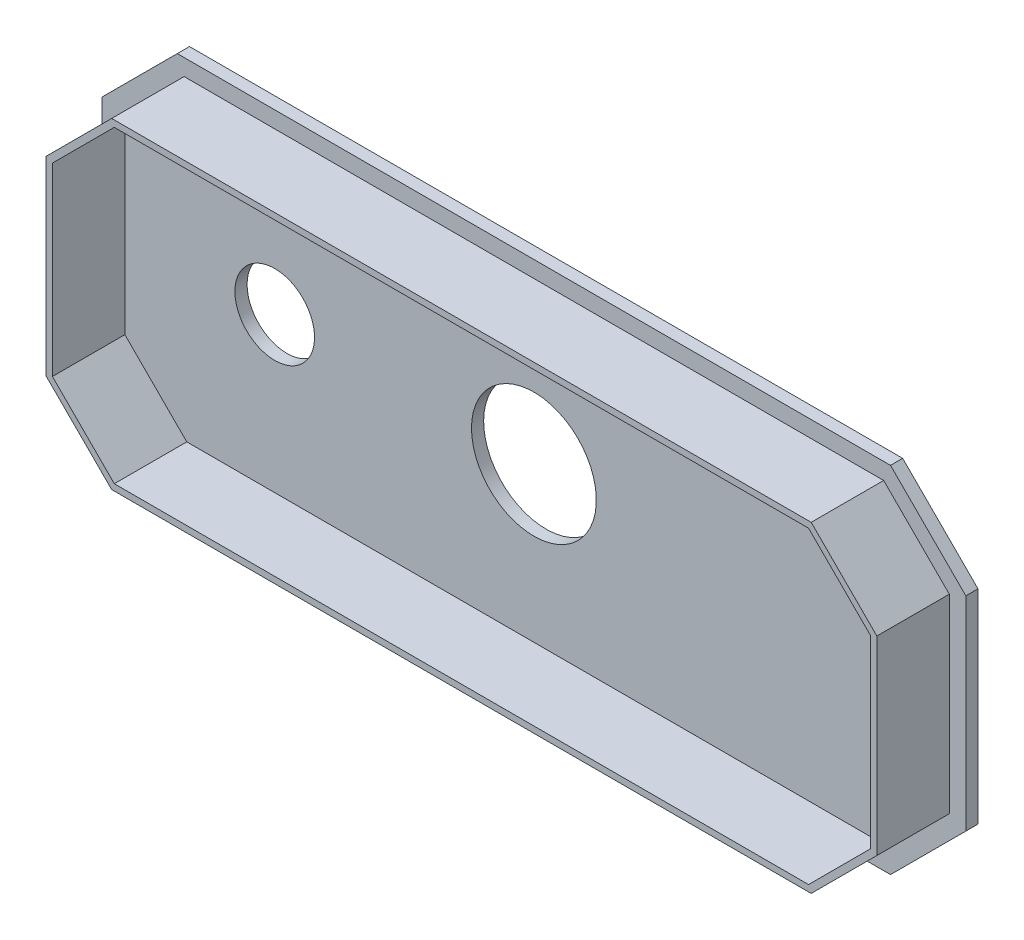
ISO-10303-21;
HEADER;
FILE_DESCRIPTION(('STEP AP214'),'2;1');
FILE_NAME('part.step','',(''),(''),'','','');
FILE_SCHEMA(('AUTOMOTIVE_DESIGN { 1 0 10303 214 1 1 1 1 }'));
ENDSEC;
DATA;
#1=APPLICATION_CONTEXT('core data for automotive mechanical design processes');
#2=APPLICATION_PROTOCOL_DEFINITION('international standard','automotive_design',2000,#1);
#3=PRODUCT_CONTEXT('',#1,'mechanical');
#4=PRODUCT('Part','Part','',(#3));
#5=PRODUCT_RELATED_PRODUCT_CATEGORY('part','',(#4));
#6=PRODUCT_DEFINITION_FORMATION('','',#4);
#7=PRODUCT_DEFINITION_CONTEXT('part definition',#1,'design');
#8=PRODUCT_DEFINITION('design','',#6,#7);
#9=PRODUCT_DEFINITION_SHAPE('','',#8);
#10=(LENGTH_UNIT() NAMED_UNIT(*) SI_UNIT(.MILLI.,.METRE.));
#11=(NAMED_UNIT(*) PLANE_ANGLE_UNIT() SI_UNIT($,.RADIAN.));
#12=(NAMED_UNIT(*) SI_UNIT($,.STERADIAN.) SOLID_ANGLE_UNIT());
#13=UNCERTAINTY_MEASURE_WITH_UNIT(LENGTH_MEASURE(1.E-05),#10,'distance_accuracy_value','');
#14=(GEOMETRIC_REPRESENTATION_CONTEXT(3) GLOBAL_UNCERTAINTY_ASSIGNED_CONTEXT((#13)) GLOBAL_UNIT_ASSIGNED_CONTEXT((#10,
#11,#12)) REPRESENTATION_CONTEXT('',''));
#15=CARTESIAN_POINT('',(0.,0.,0.));
#16=DIRECTION('',(0.,0.,1.));
#17=DIRECTION('',(1.,0.,0.));
#18=AXIS2_PLACEMENT_3D('',#15,#16,#17);
#19=CARTESIAN_POINT('',(0.,0.,0.8));
#20=DIRECTION('',(0.,0.,-1.));
#21=DIRECTION('',(-1.,0.,0.));
#22=AXIS2_PLACEMENT_3D('',#19,#20,#21);
#23=PLANE('',#22);
#24=DIRECTION('',(0.,1.,0.));
#25=VECTOR('',#24,1.);
#26=CARTESIAN_POINT('',(28.3845,-11.6459,0.8));
#27=LINE('',#26,#25);
#28=CARTESIAN_POINT('',(28.3845,-6.69615253169414,0.8));
#29=VERTEX_POINT('',#28);
#30=CARTESIAN_POINT('',(28.3845,6.6961525316942,0.8));
#31=VERTEX_POINT('',#30);
#32=EDGE_CURVE('E374',#29,#31,#27,.T.);
#33=ORIENTED_EDGE('',*,*,#32,.T.);
#34=DIRECTION('',(0.707106781186551,-0.707106781186544,0.));
#35=VECTOR('',#34,1.);
#36=CARTESIAN_POINT('',(23.4347525316941,11.6459,0.8));
#37=LINE('',#36,#35);
#38=CARTESIAN_POINT('',(23.4347525316941,11.6459,0.8));
#39=VERTEX_POINT('',#38);
#40=EDGE_CURVE('E331',#39,#31,#37,.T.);
#41=ORIENTED_EDGE('',*,*,#40,.F.);
#42=DIRECTION('',(-1.,0.,0.));
#43=VECTOR('',#42,1.);
#44=CARTESIAN_POINT('',(-28.3845,11.6459,0.8));
#45=LINE('',#44,#43);
#46=CARTESIAN_POINT('',(-23.4347525316941,11.6459,0.8));
#47=VERTEX_POINT('',#46);
#48=EDGE_CURVE('E377',#39,#47,#45,.T.);
#49=ORIENTED_EDGE('',*,*,#48,.T.);
#50=DIRECTION('',(0.707106781186551,0.707106781186544,0.));
#51=VECTOR('',#50,1.);
#52=CARTESIAN_POINT('',(-28.3845,6.6961525316942,0.8));
#53=LINE('',#52,#51);
#54=CARTESIAN_POINT('',(-28.3845,6.6961525316942,0.8));
#55=VERTEX_POINT('',#54);
#56=EDGE_CURVE('E350',#55,#47,#53,.T.);
#57=ORIENTED_EDGE('',*,*,#56,.F.);
#58=DIRECTION('',(0.,-1.,0.));
#59=VECTOR('',#58,1.);
#60=CARTESIAN_POINT('',(-28.3845,-11.6459,0.8));
#61=LINE('',#60,#59);
#62=CARTESIAN_POINT('',(-28.3845,-6.69615253169414,0.8));
#63=VERTEX_POINT('',#62);
#64=EDGE_CURVE('E46',#55,#63,#61,.T.);
#65=ORIENTED_EDGE('',*,*,#64,.T.);
#66=DIRECTION('',(-0.707106781186544,0.707106781186551,0.));
#67=VECTOR('',#66,1.);
#68=CARTESIAN_POINT('',(-28.3845,-6.69615253169414,0.8));
#69=LINE('',#68,#67);
#70=CARTESIAN_POINT('',(-23.4347525316942,-11.6459,0.8));
#71=VERTEX_POINT('',#70);
#72=EDGE_CURVE('E361',#71,#63,#69,.T.);
#73=ORIENTED_EDGE('',*,*,#72,.F.);
#74=DIRECTION('',(1.,0.,0.));
#75=VECTOR('',#74,1.);
#76=CARTESIAN_POINT('',(-28.3845,-11.6459,0.8));
#77=LINE('',#76,#75);
#78=CARTESIAN_POINT('',(23.4347525316942,-11.6459,0.8));
#79=VERTEX_POINT('',#78);
#80=EDGE_CURVE('E11',#71,#79,#77,.T.);
#81=ORIENTED_EDGE('',*,*,#80,.T.);
#82=DIRECTION('',(-0.707106781186544,-0.707106781186551,0.));
#83=VECTOR('',#82,1.);
#84=CARTESIAN_POINT('',(23.4347525316942,-11.6459,0.8));
#85=LINE('',#84,#83);
#86=EDGE_CURVE('E340',#29,#79,#85,.T.);
#87=ORIENTED_EDGE('',*,*,#86,.F.);
#88=EDGE_LOOP('',(#33,#41,#49,#57,#65,#73,#81,#87));
#89=FACE_BOUND('',#88,.T.);
#90=DIRECTION('',(-0.707106781186552,0.707106781186544,0.));
#91=VECTOR('',#90,1.);
#92=CARTESIAN_POINT('',(27.299700114,6.24681370645221,0.8));
#93=LINE('',#92,#91);
#94=CARTESIAN_POINT('',(27.299700114,6.24681370645221,0.8));
#95=VERTEX_POINT('',#94);
#96=CARTESIAN_POINT('',(22.9854137064521,10.561100114,0.8));
#97=VERTEX_POINT('',#96);
#98=EDGE_CURVE('E217',#95,#97,#93,.T.);
#99=ORIENTED_EDGE('',*,*,#98,.F.);
#100=DIRECTION('',(0.,1.,0.));
#101=VECTOR('',#100,1.);
#102=CARTESIAN_POINT('',(27.299700114,-6.24681370645216,0.8));
#103=LINE('',#102,#101);
#104=CARTESIAN_POINT('',(27.299700114,-6.24681370645216,0.8));
#105=VERTEX_POINT('',#104);
#106=EDGE_CURVE('E276',#105,#95,#103,.T.);
#107=ORIENTED_EDGE('',*,*,#106,.F.);
#108=DIRECTION('',(0.707106781186543,0.707106781186552,0.));
#109=VECTOR('',#108,1.);
#110=CARTESIAN_POINT('',(22.9854137064522,-10.561100114,0.8));
#111=LINE('',#110,#109);
#112=CARTESIAN_POINT('',(22.9854137064522,-10.561100114,0.8));
#113=VERTEX_POINT('',#112);
#114=EDGE_CURVE('E304',#113,#105,#111,.T.);
#115=ORIENTED_EDGE('',*,*,#114,.F.);
#116=DIRECTION('',(1.,0.,0.));
#117=VECTOR('',#116,1.);
#118=CARTESIAN_POINT('',(-22.9854137064522,-10.561100114,0.8));
#119=LINE('',#118,#117);
#120=CARTESIAN_POINT('',(-22.9854137064522,-10.561100114,0.8));
#121=VERTEX_POINT('',#120);
#122=EDGE_CURVE('E301',#121,#113,#119,.T.);
#123=ORIENTED_EDGE('',*,*,#122,.F.);
#124=DIRECTION('',(0.707106781186544,-0.707106781186551,0.));
#125=VECTOR('',#124,1.);
#126=CARTESIAN_POINT('',(-27.299700114,-6.24681370645216,0.8));
#127=LINE('',#126,#125);
#128=CARTESIAN_POINT('',(-27.299700114,-6.24681370645216,0.8));
#129=VERTEX_POINT('',#128);
#130=EDGE_CURVE('E298',#129,#121,#127,.T.);
#131=ORIENTED_EDGE('',*,*,#130,.F.);
#132=DIRECTION('',(0.,-1.,0.));
#133=VECTOR('',#132,1.);
#134=CARTESIAN_POINT('',(-27.299700114,6.24681370645221,0.8));
#135=LINE('',#134,#133);
#136=CARTESIAN_POINT('',(-27.299700114,6.24681370645221,0.8));
#137=VERTEX_POINT('',#136);
#138=EDGE_CURVE('E295',#137,#129,#135,.T.);
#139=ORIENTED_EDGE('',*,*,#138,.F.);
#140=DIRECTION('',(-0.707106781186551,-0.707106781186544,0.));
#141=VECTOR('',#140,1.);
#142=CARTESIAN_POINT('',(-22.9854137064522,10.561100114,0.8));
#143=LINE('',#142,#141);
#144=CARTESIAN_POINT('',(-22.9854137064522,10.561100114,0.8));
#145=VERTEX_POINT('',#144);
#146=EDGE_CURVE('E59',#145,#137,#143,.T.);
#147=ORIENTED_EDGE('',*,*,#146,.F.);
#148=DIRECTION('',(-1.,0.,0.));
#149=VECTOR('',#148,1.);
#150=CARTESIAN_POINT('',(22.9854137064521,10.561100114,0.8));
#151=LINE('',#150,#149);
#152=EDGE_CURVE('E54',#97,#145,#151,.T.);
#153=ORIENTED_EDGE('',*,*,#152,.F.);
#154=EDGE_LOOP('',(#99,#107,#115,#123,#131,#139,#147,#153));
#155=FACE_BOUND('',#154,.T.);
#156=ADVANCED_FACE('F37',(#89,#155),#23,.F.);
#157=CARTESIAN_POINT('',(28.3845,-11.6459,0.8));
#158=DIRECTION('',(-1.,0.,0.));
#159=DIRECTION('',(0.,0.,1.));
#160=AXIS2_PLACEMENT_3D('',#157,#158,#159);
#161=PLANE('',#160);
#162=DIRECTION('',(0.,1.,0.));
#163=VECTOR('',#162,1.);
#164=CARTESIAN_POINT('',(28.3845,-11.6459,0.));
#165=LINE('',#164,#163);
#166=CARTESIAN_POINT('',(28.3845,-6.69615253169414,0.));
#167=VERTEX_POINT('',#166);
#168=CARTESIAN_POINT('',(28.3845,6.69615253169419,0.));
#169=VERTEX_POINT('',#168);
#170=EDGE_CURVE('E372',#167,#169,#165,.T.);
#171=ORIENTED_EDGE('',*,*,#170,.T.);
#172=DIRECTION('',(0.,0.,1.));
#173=VECTOR('',#172,1.);
#174=CARTESIAN_POINT('',(28.3845,6.6961525316942,0.));
#175=LINE('',#174,#173);
#176=EDGE_CURVE('E337',#169,#31,#175,.T.);
#177=ORIENTED_EDGE('',*,*,#176,.T.);
#178=ORIENTED_EDGE('',*,*,#32,.F.);
#179=DIRECTION('',(0.,0.,1.));
#180=VECTOR('',#179,1.);
#181=CARTESIAN_POINT('',(28.3845,-6.69615253169414,0.));
#182=LINE('',#181,#180);
#183=EDGE_CURVE('E345',#167,#29,#182,.T.);
#184=ORIENTED_EDGE('',*,*,#183,.F.);
#185=EDGE_LOOP('',(#171,#177,#178,#184));
#186=FACE_BOUND('',#185,.T.);
#187=ADVANCED_FACE('F39',(#186),#161,.F.);
#188=CARTESIAN_POINT('',(-28.3845,11.6459,0.8));
#189=DIRECTION('',(0.,-1.,0.));
#190=DIRECTION('',(0.,0.,-1.));
#191=AXIS2_PLACEMENT_3D('',#188,#189,#190);
#192=PLANE('',#191);
#193=ORIENTED_EDGE('',*,*,#48,.F.);
#194=DIRECTION('',(0.,0.,1.));
#195=VECTOR('',#194,1.);
#196=CARTESIAN_POINT('',(23.4347525316941,11.6459,0.));
#197=LINE('',#196,#195);
#198=CARTESIAN_POINT('',(23.4347525316941,11.6459,0.));
#199=VERTEX_POINT('',#198);
#200=EDGE_CURVE('E335',#199,#39,#197,.T.);
#201=ORIENTED_EDGE('',*,*,#200,.F.);
#202=DIRECTION('',(-1.,0.,0.));
#203=VECTOR('',#202,1.);
#204=CARTESIAN_POINT('',(-28.3845,11.6459,0.));
#205=LINE('',#204,#203);
#206=CARTESIAN_POINT('',(-23.4347525316941,11.6459,0.));
#207=VERTEX_POINT('',#206);
#208=EDGE_CURVE('E383',#199,#207,#205,.T.);
#209=ORIENTED_EDGE('',*,*,#208,.T.);
#210=DIRECTION('',(0.,0.,1.));
#211=VECTOR('',#210,1.);
#212=CARTESIAN_POINT('',(-23.4347525316941,11.6459,0.));
#213=LINE('',#212,#211);
#214=EDGE_CURVE('E358',#207,#47,#213,.T.);
#215=ORIENTED_EDGE('',*,*,#214,.T.);
#216=EDGE_LOOP('',(#193,#201,#209,#215));
#217=FACE_BOUND('',#216,.T.);
#218=ADVANCED_FACE('F441',(#217),#192,.F.);
#219=CARTESIAN_POINT('',(-28.3845,-11.6459,0.8));
#220=DIRECTION('',(1.,0.,0.));
#221=DIRECTION('',(0.,0.,-1.));
#222=AXIS2_PLACEMENT_3D('',#219,#220,#221);
#223=PLANE('',#222);
#224=ORIENTED_EDGE('',*,*,#64,.F.);
#225=DIRECTION('',(0.,0.,1.));
#226=VECTOR('',#225,1.);
#227=CARTESIAN_POINT('',(-28.3845,6.6961525316942,0.));
#228=LINE('',#227,#226);
#229=CARTESIAN_POINT('',(-28.3845,6.6961525316942,0.));
#230=VERTEX_POINT('',#229);
#231=EDGE_CURVE('E355',#230,#55,#228,.T.);
#232=ORIENTED_EDGE('',*,*,#231,.F.);
#233=DIRECTION('',(0.,-1.,0.));
#234=VECTOR('',#233,1.);
#235=CARTESIAN_POINT('',(-28.3845,-11.6459,0.));
#236=LINE('',#235,#234);
#237=CARTESIAN_POINT('',(-28.3845,-6.69615253169415,0.));
#238=VERTEX_POINT('',#237);
#239=EDGE_CURVE('E385',#230,#238,#236,.T.);
#240=ORIENTED_EDGE('',*,*,#239,.T.);
#241=DIRECTION('',(0.,0.,1.));
#242=VECTOR('',#241,1.);
#243=CARTESIAN_POINT('',(-28.3845,-6.69615253169414,0.));
#244=LINE('',#243,#242);
#245=EDGE_CURVE('E369',#238,#63,#244,.T.);
#246=ORIENTED_EDGE('',*,*,#245,.T.);
#247=EDGE_LOOP('',(#224,#232,#240,#246));
#248=FACE_BOUND('',#247,.T.);
#249=ADVANCED_FACE('F433',(#248),#223,.F.);
#250=CARTESIAN_POINT('',(-28.3845,-11.6459,0.8));
#251=DIRECTION('',(0.,1.,0.));
#252=DIRECTION('',(0.,0.,1.));
#253=AXIS2_PLACEMENT_3D('',#250,#251,#252);
#254=PLANE('',#253);
#255=DIRECTION('',(1.,0.,0.));
#256=VECTOR('',#255,1.);
#257=CARTESIAN_POINT('',(-28.3845,-11.6459,0.));
#258=LINE('',#257,#256);
#259=CARTESIAN_POINT('',(-23.4347525316942,-11.6459,0.));
#260=VERTEX_POINT('',#259);
#261=CARTESIAN_POINT('',(23.4347525316942,-11.6459,0.));
#262=VERTEX_POINT('',#261);
#263=EDGE_CURVE('E378',#260,#262,#258,.T.);
#264=ORIENTED_EDGE('',*,*,#263,.T.);
#265=DIRECTION('',(0.,0.,1.));
#266=VECTOR('',#265,1.);
#267=CARTESIAN_POINT('',(23.4347525316942,-11.6459,0.));
#268=LINE('',#267,#266);
#269=EDGE_CURVE('E347',#262,#79,#268,.T.);
#270=ORIENTED_EDGE('',*,*,#269,.T.);
#271=ORIENTED_EDGE('',*,*,#80,.F.);
#272=DIRECTION('',(0.,0.,1.));
#273=VECTOR('',#272,1.);
#274=CARTESIAN_POINT('',(-23.4347525316942,-11.6459,0.));
#275=LINE('',#274,#273);
#276=EDGE_CURVE('E366',#260,#71,#275,.T.);
#277=ORIENTED_EDGE('',*,*,#276,.F.);
#278=EDGE_LOOP('',(#264,#270,#271,#277));
#279=FACE_BOUND('',#278,.T.);
#280=ADVANCED_FACE('F408',(#279),#254,.F.);
#281=CARTESIAN_POINT('',(0.,0.,0.));
#282=DIRECTION('',(0.,0.,-1.));
#283=DIRECTION('',(-1.,0.,0.));
#284=AXIS2_PLACEMENT_3D('',#281,#282,#283);
#285=PLANE('',#284);
#286=CARTESIAN_POINT('',(0.,0.,0.));
#287=DIRECTION('',(0.,0.,-1.));
#288=DIRECTION('',(-1.,0.,0.));
#289=AXIS2_PLACEMENT_3D('',#286,#287,#288);
#290=CIRCLE('',#289,4.1021);
#291=CARTESIAN_POINT('',(-4.1021,0.,0.));
#292=VERTEX_POINT('',#291);
#293=EDGE_CURVE('E396',#292,#292,#290,.T.);
#294=ORIENTED_EDGE('',*,*,#293,.F.);
#295=EDGE_LOOP('',(#294));
#296=FACE_BOUND('',#295,.T.);
#297=CARTESIAN_POINT('',(-17.0307,0.,0.));
#298=DIRECTION('',(0.,0.,-1.));
#299=DIRECTION('',(-1.,0.,0.));
#300=AXIS2_PLACEMENT_3D('',#297,#298,#299);
#301=CIRCLE('',#300,2.6162);
#302=CARTESIAN_POINT('',(-19.6469,0.,0.));
#303=VERTEX_POINT('',#302);
#304=EDGE_CURVE('E389',#303,#303,#301,.T.);
#305=ORIENTED_EDGE('',*,*,#304,.F.);
#306=EDGE_LOOP('',(#305));
#307=FACE_BOUND('',#306,.T.);
#308=DIRECTION('',(0.707106781186551,-0.707106781186544,0.));
#309=VECTOR('',#308,1.);
#310=CARTESIAN_POINT('',(23.4347525316941,11.6459,0.));
#311=LINE('',#310,#309);
#312=EDGE_CURVE('E332',#199,#169,#311,.T.);
#313=ORIENTED_EDGE('',*,*,#312,.T.);
#314=ORIENTED_EDGE('',*,*,#170,.F.);
#315=DIRECTION('',(-0.707106781186544,-0.707106781186551,0.));
#316=VECTOR('',#315,1.);
#317=CARTESIAN_POINT('',(23.4347525316942,-11.6459,0.));
#318=LINE('',#317,#316);
#319=EDGE_CURVE('E342',#167,#262,#318,.T.);
#320=ORIENTED_EDGE('',*,*,#319,.T.);
#321=ORIENTED_EDGE('',*,*,#263,.F.);
#322=DIRECTION('',(-0.707106781186544,0.707106781186551,0.));
#323=VECTOR('',#322,1.);
#324=CARTESIAN_POINT('',(-28.3845,-6.69615253169414,0.));
#325=LINE('',#324,#323);
#326=EDGE_CURVE('E363',#260,#238,#325,.T.);
#327=ORIENTED_EDGE('',*,*,#326,.T.);
#328=ORIENTED_EDGE('',*,*,#239,.F.);
#329=DIRECTION('',(0.707106781186551,0.707106781186544,0.));
#330=VECTOR('',#329,1.);
#331=CARTESIAN_POINT('',(-28.3845,6.6961525316942,0.));
#332=LINE('',#331,#330);
#333=EDGE_CURVE('E352',#230,#207,#332,.T.);
#334=ORIENTED_EDGE('',*,*,#333,.T.);
#335=ORIENTED_EDGE('',*,*,#208,.F.);
#336=EDGE_LOOP('',(#313,#314,#320,#321,#327,#328,#334,#335));
#337=FACE_BOUND('',#336,.T.);
#338=ADVANCED_FACE('F404',(#296,#307,#337),#285,.T.);
#339=CARTESIAN_POINT('',(-28.3845,-6.69615253169414,0.));
#340=DIRECTION('',(0.707106781186551,0.707106781186544,0.));
#341=DIRECTION('',(-0.707106781186544,0.707106781186551,0.));
#342=AXIS2_PLACEMENT_3D('',#339,#340,#341);
#343=PLANE('',#342);
#344=ORIENTED_EDGE('',*,*,#72,.T.);
#345=ORIENTED_EDGE('',*,*,#245,.F.);
#346=ORIENTED_EDGE('',*,*,#326,.F.);
#347=ORIENTED_EDGE('',*,*,#276,.T.);
#348=EDGE_LOOP('',(#344,#345,#346,#347));
#349=FACE_BOUND('',#348,.T.);
#350=ADVANCED_FACE('F407',(#349),#343,.F.);
#351=CARTESIAN_POINT('',(-28.3845,6.6961525316942,0.));
#352=DIRECTION('',(0.707106781186544,-0.707106781186551,0.));
#353=DIRECTION('',(0.707106781186551,0.707106781186544,0.));
#354=AXIS2_PLACEMENT_3D('',#351,#352,#353);
#355=PLANE('',#354);
#356=ORIENTED_EDGE('',*,*,#56,.T.);
#357=ORIENTED_EDGE('',*,*,#214,.F.);
#358=ORIENTED_EDGE('',*,*,#333,.F.);
#359=ORIENTED_EDGE('',*,*,#231,.T.);
#360=EDGE_LOOP('',(#356,#357,#358,#359));
#361=FACE_BOUND('',#360,.T.);
#362=ADVANCED_FACE('F437',(#361),#355,.F.);
#363=CARTESIAN_POINT('',(23.4347525316942,-11.6459,0.));
#364=DIRECTION('',(-0.707106781186551,0.707106781186544,0.));
#365=DIRECTION('',(-0.707106781186544,-0.707106781186551,0.));
#366=AXIS2_PLACEMENT_3D('',#363,#364,#365);
#367=PLANE('',#366);
#368=ORIENTED_EDGE('',*,*,#86,.T.);
#369=ORIENTED_EDGE('',*,*,#269,.F.);
#370=ORIENTED_EDGE('',*,*,#319,.F.);
#371=ORIENTED_EDGE('',*,*,#183,.T.);
#372=EDGE_LOOP('',(#368,#369,#370,#371));
#373=FACE_BOUND('',#372,.T.);
#374=ADVANCED_FACE('F420',(#373),#367,.F.);
#375=CARTESIAN_POINT('',(23.4347525316941,11.6459,0.));
#376=DIRECTION('',(-0.707106781186544,-0.707106781186551,0.));
#377=DIRECTION('',(0.707106781186551,-0.707106781186544,0.));
#378=AXIS2_PLACEMENT_3D('',#375,#376,#377);
#379=PLANE('',#378);
#380=ORIENTED_EDGE('',*,*,#40,.T.);
#381=ORIENTED_EDGE('',*,*,#176,.F.);
#382=ORIENTED_EDGE('',*,*,#312,.F.);
#383=ORIENTED_EDGE('',*,*,#200,.T.);
#384=EDGE_LOOP('',(#380,#381,#382,#383));
#385=FACE_BOUND('',#384,.T.);
#386=ADVANCED_FACE('F442',(#385),#379,.F.);
#387=CARTESIAN_POINT('',(0.,0.,5.5625));
#388=DIRECTION('',(0.,0.,1.));
#389=DIRECTION('',(1.,0.,0.));
#390=AXIS2_PLACEMENT_3D('',#387,#388,#389);
#391=PLANE('',#390);
#392=DIRECTION('',(-0.707106781186552,0.707106781186544,0.));
#393=VECTOR('',#392,1.);
#394=CARTESIAN_POINT('',(27.299700114,6.24681370645221,5.5625));
#395=LINE('',#394,#393);
#396=CARTESIAN_POINT('',(27.299700114,6.24681370645221,5.5625));
#397=VERTEX_POINT('',#396);
#398=CARTESIAN_POINT('',(22.9854137064521,10.561100114,5.5625));
#399=VERTEX_POINT('',#398);
#400=EDGE_CURVE('E272',#397,#399,#395,.T.);
#401=ORIENTED_EDGE('',*,*,#400,.T.);
#402=DIRECTION('',(-1.,0.,0.));
#403=VECTOR('',#402,1.);
#404=CARTESIAN_POINT('',(22.9854137064521,10.561100114,5.5625));
#405=LINE('',#404,#403);
#406=CARTESIAN_POINT('',(-22.9854137064522,10.561100114,5.5625));
#407=VERTEX_POINT('',#406);
#408=EDGE_CURVE('E275',#399,#407,#405,.T.);
#409=ORIENTED_EDGE('',*,*,#408,.T.);
#410=DIRECTION('',(-0.707106781186551,-0.707106781186544,0.));
#411=VECTOR('',#410,1.);
#412=CARTESIAN_POINT('',(-22.9854137064522,10.561100114,5.5625));
#413=LINE('',#412,#411);
#414=CARTESIAN_POINT('',(-27.299700114,6.24681370645221,5.5625));
#415=VERTEX_POINT('',#414);
#416=EDGE_CURVE('E278',#407,#415,#413,.T.);
#417=ORIENTED_EDGE('',*,*,#416,.T.);
#418=DIRECTION('',(0.,-1.,0.));
#419=VECTOR('',#418,1.);
#420=CARTESIAN_POINT('',(-27.299700114,6.24681370645221,5.5625));
#421=LINE('',#420,#419);
#422=CARTESIAN_POINT('',(-27.299700114,-6.24681370645216,5.5625));
#423=VERTEX_POINT('',#422);
#424=EDGE_CURVE('E280',#415,#423,#421,.T.);
#425=ORIENTED_EDGE('',*,*,#424,.T.);
#426=DIRECTION('',(0.707106781186544,-0.707106781186551,0.));
#427=VECTOR('',#426,1.);
#428=CARTESIAN_POINT('',(-27.299700114,-6.24681370645216,5.5625));
#429=LINE('',#428,#427);
#430=CARTESIAN_POINT('',(-22.9854137064522,-10.561100114,5.5625));
#431=VERTEX_POINT('',#430);
#432=EDGE_CURVE('E282',#423,#431,#429,.T.);
#433=ORIENTED_EDGE('',*,*,#432,.T.);
#434=DIRECTION('',(1.,0.,0.));
#435=VECTOR('',#434,1.);
#436=CARTESIAN_POINT('',(-22.9854137064522,-10.561100114,5.5625));
#437=LINE('',#436,#435);
#438=CARTESIAN_POINT('',(22.9854137064522,-10.561100114,5.5625));
#439=VERTEX_POINT('',#438);
#440=EDGE_CURVE('E284',#431,#439,#437,.T.);
#441=ORIENTED_EDGE('',*,*,#440,.T.);
#442=DIRECTION('',(0.707106781186543,0.707106781186552,0.));
#443=VECTOR('',#442,1.);
#444=CARTESIAN_POINT('',(22.9854137064522,-10.561100114,5.5625));
#445=LINE('',#444,#443);
#446=CARTESIAN_POINT('',(27.299700114,-6.24681370645216,5.5625));
#447=VERTEX_POINT('',#446);
#448=EDGE_CURVE('E286',#439,#447,#445,.T.);
#449=ORIENTED_EDGE('',*,*,#448,.T.);
#450=DIRECTION('',(0.,1.,0.));
#451=VECTOR('',#450,1.);
#452=CARTESIAN_POINT('',(27.299700114,-6.24681370645216,5.5625));
#453=LINE('',#452,#451);
#454=EDGE_CURVE('E288',#447,#397,#453,.T.);
#455=ORIENTED_EDGE('',*,*,#454,.T.);
#456=EDGE_LOOP('',(#401,#409,#417,#425,#433,#441,#449,#455));
#457=FACE_BOUND('',#456,.T.);
#458=DIRECTION('',(-0.707106781186551,-0.707106781186544,0.));
#459=VECTOR('',#458,1.);
#460=CARTESIAN_POINT('',(-22.8114440102555,10.141100114,5.5625));
#461=LINE('',#460,#459);
#462=CARTESIAN_POINT('',(-22.8114440102555,10.141100114,5.5625));
#463=VERTEX_POINT('',#462);
#464=CARTESIAN_POINT('',(-26.879700114,6.0728440102555,5.5625));
#465=VERTEX_POINT('',#464);
#466=EDGE_CURVE('E209',#463,#465,#461,.T.);
#467=ORIENTED_EDGE('',*,*,#466,.F.);
#468=DIRECTION('',(-1.,0.,0.));
#469=VECTOR('',#468,1.);
#470=CARTESIAN_POINT('',(22.8114440102555,10.141100114,5.5625));
#471=LINE('',#470,#469);
#472=CARTESIAN_POINT('',(22.8114440102555,10.141100114,5.5625));
#473=VERTEX_POINT('',#472);
#474=EDGE_CURVE('E199',#473,#463,#471,.T.);
#475=ORIENTED_EDGE('',*,*,#474,.F.);
#476=DIRECTION('',(-0.707106781186552,0.707106781186544,0.));
#477=VECTOR('',#476,1.);
#478=CARTESIAN_POINT('',(26.879700114,6.0728440102555,5.5625));
#479=LINE('',#478,#477);
#480=CARTESIAN_POINT('',(26.879700114,6.0728440102555,5.5625));
#481=VERTEX_POINT('',#480);
#482=EDGE_CURVE('E237',#481,#473,#479,.T.);
#483=ORIENTED_EDGE('',*,*,#482,.F.);
#484=DIRECTION('',(0.,1.,0.));
#485=VECTOR('',#484,1.);
#486=CARTESIAN_POINT('',(26.879700114,-6.07284401025546,5.5625));
#487=LINE('',#486,#485);
#488=CARTESIAN_POINT('',(26.879700114,-6.07284401025546,5.5625));
#489=VERTEX_POINT('',#488);
#490=EDGE_CURVE('E234',#489,#481,#487,.T.);
#491=ORIENTED_EDGE('',*,*,#490,.F.);
#492=DIRECTION('',(0.707106781186544,0.707106781186552,0.));
#493=VECTOR('',#492,1.);
#494=CARTESIAN_POINT('',(22.8114440102555,-10.141100114,5.5625));
#495=LINE('',#494,#493);
#496=CARTESIAN_POINT('',(22.8114440102555,-10.141100114,5.5625));
#497=VERTEX_POINT('',#496);
#498=EDGE_CURVE('E232',#497,#489,#495,.T.);
#499=ORIENTED_EDGE('',*,*,#498,.F.);
#500=DIRECTION('',(1.,0.,0.));
#501=VECTOR('',#500,1.);
#502=CARTESIAN_POINT('',(-22.8114440102555,-10.141100114,5.5625));
#503=LINE('',#502,#501);
#504=CARTESIAN_POINT('',(-22.8114440102555,-10.141100114,5.5625));
#505=VERTEX_POINT('',#504);
#506=EDGE_CURVE('E230',#505,#497,#503,.T.);
#507=ORIENTED_EDGE('',*,*,#506,.F.);
#508=DIRECTION('',(0.707106781186544,-0.707106781186551,0.));
#509=VECTOR('',#508,1.);
#510=CARTESIAN_POINT('',(-26.879700114,-6.07284401025546,5.5625));
#511=LINE('',#510,#509);
#512=CARTESIAN_POINT('',(-26.879700114,-6.07284401025546,5.5625));
#513=VERTEX_POINT('',#512);
#514=EDGE_CURVE('E225',#513,#505,#511,.T.);
#515=ORIENTED_EDGE('',*,*,#514,.F.);
#516=DIRECTION('',(0.,-1.,0.));
#517=VECTOR('',#516,1.);
#518=CARTESIAN_POINT('',(-26.879700114,6.0728440102555,5.5625));
#519=LINE('',#518,#517);
#520=EDGE_CURVE('E223',#465,#513,#519,.T.);
#521=ORIENTED_EDGE('',*,*,#520,.F.);
#522=EDGE_LOOP('',(#467,#475,#483,#491,#499,#507,#515,#521));
#523=FACE_BOUND('',#522,.T.);
#524=ADVANCED_FACE('F221',(#457,#523),#391,.T.);
#525=CARTESIAN_POINT('',(27.299700114,6.24681370645221,5.5625));
#526=DIRECTION('',(-0.707106781186544,-0.707106781186552,0.));
#527=DIRECTION('',(0.707106781186552,-0.707106781186544,0.));
#528=AXIS2_PLACEMENT_3D('',#525,#526,#527);
#529=PLANE('',#528);
#530=ORIENTED_EDGE('',*,*,#98,.T.);
#531=DIRECTION('',(0.,0.,-1.));
#532=VECTOR('',#531,1.);
#533=CARTESIAN_POINT('',(22.9854137064521,10.561100114,5.5625));
#534=LINE('',#533,#532);
#535=EDGE_CURVE('E329',#399,#97,#534,.T.);
#536=ORIENTED_EDGE('',*,*,#535,.F.);
#537=ORIENTED_EDGE('',*,*,#400,.F.);
#538=DIRECTION('',(0.,0.,-1.));
#539=VECTOR('',#538,1.);
#540=CARTESIAN_POINT('',(27.299700114,6.24681370645221,5.5625));
#541=LINE('',#540,#539);
#542=EDGE_CURVE('E290',#397,#95,#541,.T.);
#543=ORIENTED_EDGE('',*,*,#542,.T.);
#544=EDGE_LOOP('',(#530,#536,#537,#543));
#545=FACE_BOUND('',#544,.T.);
#546=ADVANCED_FACE('F449',(#545),#529,.F.);
#547=CARTESIAN_POINT('',(22.9854137064521,10.561100114,5.5625));
#548=DIRECTION('',(0.,-1.,0.));
#549=DIRECTION('',(1.,0.,0.));
#550=AXIS2_PLACEMENT_3D('',#547,#548,#549);
#551=PLANE('',#550);
#552=ORIENTED_EDGE('',*,*,#152,.T.);
#553=DIRECTION('',(0.,0.,-1.));
#554=VECTOR('',#553,1.);
#555=CARTESIAN_POINT('',(-22.9854137064522,10.561100114,5.5625));
#556=LINE('',#555,#554);
#557=EDGE_CURVE('E326',#407,#145,#556,.T.);
#558=ORIENTED_EDGE('',*,*,#557,.F.);
#559=ORIENTED_EDGE('',*,*,#408,.F.);
#560=ORIENTED_EDGE('',*,*,#535,.T.);
#561=EDGE_LOOP('',(#552,#558,#559,#560));
#562=FACE_BOUND('',#561,.T.);
#563=ADVANCED_FACE('F532',(#562),#551,.F.);
#564=CARTESIAN_POINT('',(-22.9854137064522,10.561100114,5.5625));
#565=DIRECTION('',(0.707106781186544,-0.707106781186551,0.));
#566=DIRECTION('',(0.707106781186551,0.707106781186544,0.));
#567=AXIS2_PLACEMENT_3D('',#564,#565,#566);
#568=PLANE('',#567);
#569=ORIENTED_EDGE('',*,*,#146,.T.);
#570=DIRECTION('',(0.,0.,-1.));
#571=VECTOR('',#570,1.);
#572=CARTESIAN_POINT('',(-27.299700114,6.24681370645221,5.5625));
#573=LINE('',#572,#571);
#574=EDGE_CURVE('E323',#415,#137,#573,.T.);
#575=ORIENTED_EDGE('',*,*,#574,.F.);
#576=ORIENTED_EDGE('',*,*,#416,.F.);
#577=ORIENTED_EDGE('',*,*,#557,.T.);
#578=EDGE_LOOP('',(#569,#575,#576,#577));
#579=FACE_BOUND('',#578,.T.);
#580=ADVANCED_FACE('F528',(#579),#568,.F.);
#581=CARTESIAN_POINT('',(-27.299700114,6.24681370645221,5.5625));
#582=DIRECTION('',(1.,0.,0.));
#583=DIRECTION('',(0.,0.,-1.));
#584=AXIS2_PLACEMENT_3D('',#581,#582,#583);
#585=PLANE('',#584);
#586=ORIENTED_EDGE('',*,*,#138,.T.);
#587=DIRECTION('',(0.,0.,-1.));
#588=VECTOR('',#587,1.);
#589=CARTESIAN_POINT('',(-27.299700114,-6.24681370645216,5.5625));
#590=LINE('',#589,#588);
#591=EDGE_CURVE('E320',#423,#129,#590,.T.);
#592=ORIENTED_EDGE('',*,*,#591,.F.);
#593=ORIENTED_EDGE('',*,*,#424,.F.);
#594=ORIENTED_EDGE('',*,*,#574,.T.);
#595=EDGE_LOOP('',(#586,#592,#593,#594));
#596=FACE_BOUND('',#595,.T.);
#597=ADVANCED_FACE('F524',(#596),#585,.F.);
#598=CARTESIAN_POINT('',(-27.299700114,-6.24681370645216,5.5625));
#599=DIRECTION('',(0.707106781186551,0.707106781186544,0.));
#600=DIRECTION('',(-0.707106781186544,0.707106781186551,0.));
#601=AXIS2_PLACEMENT_3D('',#598,#599,#600);
#602=PLANE('',#601);
#603=ORIENTED_EDGE('',*,*,#130,.T.);
#604=DIRECTION('',(0.,0.,-1.));
#605=VECTOR('',#604,1.);
#606=CARTESIAN_POINT('',(-22.9854137064522,-10.561100114,5.5625));
#607=LINE('',#606,#605);
#608=EDGE_CURVE('E317',#431,#121,#607,.T.);
#609=ORIENTED_EDGE('',*,*,#608,.F.);
#610=ORIENTED_EDGE('',*,*,#432,.F.);
#611=ORIENTED_EDGE('',*,*,#591,.T.);
#612=EDGE_LOOP('',(#603,#609,#610,#611));
#613=FACE_BOUND('',#612,.T.);
#614=ADVANCED_FACE('F520',(#613),#602,.F.);
#615=CARTESIAN_POINT('',(-22.9854137064522,-10.561100114,5.5625));
#616=DIRECTION('',(0.,1.,0.));
#617=DIRECTION('',(-1.,0.,0.));
#618=AXIS2_PLACEMENT_3D('',#615,#616,#617);
#619=PLANE('',#618);
#620=ORIENTED_EDGE('',*,*,#122,.T.);
#621=DIRECTION('',(0.,0.,-1.));
#622=VECTOR('',#621,1.);
#623=CARTESIAN_POINT('',(22.9854137064522,-10.561100114,5.5625));
#624=LINE('',#623,#622);
#625=EDGE_CURVE('E314',#439,#113,#624,.T.);
#626=ORIENTED_EDGE('',*,*,#625,.F.);
#627=ORIENTED_EDGE('',*,*,#440,.F.);
#628=ORIENTED_EDGE('',*,*,#608,.T.);
#629=EDGE_LOOP('',(#620,#626,#627,#628));
#630=FACE_BOUND('',#629,.T.);
#631=ADVANCED_FACE('F516',(#630),#619,.F.);
#632=CARTESIAN_POINT('',(22.9854137064522,-10.561100114,5.5625));
#633=DIRECTION('',(-0.707106781186552,0.707106781186543,0.));
#634=DIRECTION('',(-0.707106781186543,-0.707106781186552,0.));
#635=AXIS2_PLACEMENT_3D('',#632,#633,#634);
#636=PLANE('',#635);
#637=ORIENTED_EDGE('',*,*,#114,.T.);
#638=DIRECTION('',(0.,0.,-1.));
#639=VECTOR('',#638,1.);
#640=CARTESIAN_POINT('',(27.299700114,-6.24681370645216,5.5625));
#641=LINE('',#640,#639);
#642=EDGE_CURVE('E311',#447,#105,#641,.T.);
#643=ORIENTED_EDGE('',*,*,#642,.F.);
#644=ORIENTED_EDGE('',*,*,#448,.F.);
#645=ORIENTED_EDGE('',*,*,#625,.T.);
#646=EDGE_LOOP('',(#637,#643,#644,#645));
#647=FACE_BOUND('',#646,.T.);
#648=ADVANCED_FACE('F512',(#647),#636,.F.);
#649=CARTESIAN_POINT('',(27.299700114,-6.24681370645216,5.5625));
#650=DIRECTION('',(-1.,0.,0.));
#651=DIRECTION('',(0.,0.,1.));
#652=AXIS2_PLACEMENT_3D('',#649,#650,#651);
#653=PLANE('',#652);
#654=ORIENTED_EDGE('',*,*,#106,.T.);
#655=ORIENTED_EDGE('',*,*,#542,.F.);
#656=ORIENTED_EDGE('',*,*,#454,.F.);
#657=ORIENTED_EDGE('',*,*,#642,.T.);
#658=EDGE_LOOP('',(#654,#655,#656,#657));
#659=FACE_BOUND('',#658,.T.);
#660=ADVANCED_FACE('F508',(#659),#653,.F.);
#661=CARTESIAN_POINT('',(22.8114440102555,10.141100114,5.5625));
#662=DIRECTION('',(0.,-1.,0.));
#663=DIRECTION('',(0.,0.,-1.));
#664=AXIS2_PLACEMENT_3D('',#661,#662,#663);
#665=PLANE('',#664);
#666=DIRECTION('',(-1.,0.,0.));
#667=VECTOR('',#666,1.);
#668=CARTESIAN_POINT('',(22.8114440102555,10.141100114,0.8));
#669=LINE('',#668,#667);
#670=CARTESIAN_POINT('',(22.8114440102554,10.141100114,0.8));
#671=VERTEX_POINT('',#670);
#672=CARTESIAN_POINT('',(-22.8114440102555,10.141100114,0.8));
#673=VERTEX_POINT('',#672);
#674=EDGE_CURVE('E239',#671,#673,#669,.T.);
#675=ORIENTED_EDGE('',*,*,#674,.F.);
#676=DIRECTION('',(0.,0.,-1.));
#677=VECTOR('',#676,1.);
#678=CARTESIAN_POINT('',(22.8114440102555,10.141100114,5.5625));
#679=LINE('',#678,#677);
#680=EDGE_CURVE('E205',#473,#671,#679,.T.);
#681=ORIENTED_EDGE('',*,*,#680,.F.);
#682=ORIENTED_EDGE('',*,*,#474,.T.);
#683=DIRECTION('',(0.,0.,-1.));
#684=VECTOR('',#683,1.);
#685=CARTESIAN_POINT('',(-22.8114440102555,10.141100114,5.5625));
#686=LINE('',#685,#684);
#687=EDGE_CURVE('E203',#463,#673,#686,.T.);
#688=ORIENTED_EDGE('',*,*,#687,.T.);
#689=EDGE_LOOP('',(#675,#681,#682,#688));
#690=FACE_BOUND('',#689,.T.);
#691=ADVANCED_FACE('F202',(#690),#665,.T.);
#692=CARTESIAN_POINT('',(-22.8114440102555,10.141100114,5.5625));
#693=DIRECTION('',(0.707106781186544,-0.707106781186551,0.));
#694=DIRECTION('',(0.707106781186551,0.707106781186544,0.));
#695=AXIS2_PLACEMENT_3D('',#692,#693,#694);
#696=PLANE('',#695);
#697=DIRECTION('',(-0.707106781186551,-0.707106781186544,0.));
#698=VECTOR('',#697,1.);
#699=CARTESIAN_POINT('',(-22.8114440102555,10.141100114,0.8));
#700=LINE('',#699,#698);
#701=CARTESIAN_POINT('',(-26.879700114,6.0728440102555,0.8));
#702=VERTEX_POINT('',#701);
#703=EDGE_CURVE('E216',#673,#702,#700,.T.);
#704=ORIENTED_EDGE('',*,*,#703,.F.);
#705=ORIENTED_EDGE('',*,*,#687,.F.);
#706=ORIENTED_EDGE('',*,*,#466,.T.);
#707=DIRECTION('',(0.,0.,-1.));
#708=VECTOR('',#707,1.);
#709=CARTESIAN_POINT('',(-26.879700114,6.0728440102555,5.5625));
#710=LINE('',#709,#708);
#711=EDGE_CURVE('E218',#465,#702,#710,.T.);
#712=ORIENTED_EDGE('',*,*,#711,.T.);
#713=EDGE_LOOP('',(#704,#705,#706,#712));
#714=FACE_BOUND('',#713,.T.);
#715=ADVANCED_FACE('F213',(#714),#696,.T.);
#716=CARTESIAN_POINT('',(-26.879700114,6.0728440102555,5.5625));
#717=DIRECTION('',(1.,0.,0.));
#718=DIRECTION('',(0.,0.,-1.));
#719=AXIS2_PLACEMENT_3D('',#716,#717,#718);
#720=PLANE('',#719);
#721=DIRECTION('',(0.,-1.,0.));
#722=VECTOR('',#721,1.);
#723=CARTESIAN_POINT('',(-26.879700114,6.0728440102555,0.8));
#724=LINE('',#723,#722);
#725=CARTESIAN_POINT('',(-26.879700114,-6.07284401025546,0.8));
#726=VERTEX_POINT('',#725);
#727=EDGE_CURVE('E243',#702,#726,#724,.T.);
#728=ORIENTED_EDGE('',*,*,#727,.F.);
#729=ORIENTED_EDGE('',*,*,#711,.F.);
#730=ORIENTED_EDGE('',*,*,#520,.T.);
#731=DIRECTION('',(0.,0.,-1.));
#732=VECTOR('',#731,1.);
#733=CARTESIAN_POINT('',(-26.879700114,-6.07284401025546,5.5625));
#734=LINE('',#733,#732);
#735=EDGE_CURVE('E269',#513,#726,#734,.T.);
#736=ORIENTED_EDGE('',*,*,#735,.T.);
#737=EDGE_LOOP('',(#728,#729,#730,#736));
#738=FACE_BOUND('',#737,.T.);
#739=ADVANCED_FACE('F496',(#738),#720,.T.);
#740=CARTESIAN_POINT('',(-26.879700114,-6.07284401025546,5.5625));
#741=DIRECTION('',(0.707106781186551,0.707106781186544,0.));
#742=DIRECTION('',(-0.707106781186544,0.707106781186551,0.));
#743=AXIS2_PLACEMENT_3D('',#740,#741,#742);
#744=PLANE('',#743);
#745=DIRECTION('',(0.707106781186544,-0.707106781186551,0.));
#746=VECTOR('',#745,1.);
#747=CARTESIAN_POINT('',(-26.879700114,-6.07284401025546,0.8));
#748=LINE('',#747,#746);
#749=CARTESIAN_POINT('',(-22.8114440102555,-10.141100114,0.8));
#750=VERTEX_POINT('',#749);
#751=EDGE_CURVE('E246',#726,#750,#748,.T.);
#752=ORIENTED_EDGE('',*,*,#751,.F.);
#753=ORIENTED_EDGE('',*,*,#735,.F.);
#754=ORIENTED_EDGE('',*,*,#514,.T.);
#755=DIRECTION('',(0.,0.,-1.));
#756=VECTOR('',#755,1.);
#757=CARTESIAN_POINT('',(-22.8114440102555,-10.141100114,5.5625));
#758=LINE('',#757,#756);
#759=EDGE_CURVE('E267',#505,#750,#758,.T.);
#760=ORIENTED_EDGE('',*,*,#759,.T.);
#761=EDGE_LOOP('',(#752,#753,#754,#760));
#762=FACE_BOUND('',#761,.T.);
#763=ADVANCED_FACE('F493',(#762),#744,.T.);
#764=CARTESIAN_POINT('',(-22.8114440102555,-10.141100114,5.5625));
#765=DIRECTION('',(0.,1.,0.));
#766=DIRECTION('',(-1.,0.,0.));
#767=AXIS2_PLACEMENT_3D('',#764,#765,#766);
#768=PLANE('',#767);
#769=DIRECTION('',(1.,0.,0.));
#770=VECTOR('',#769,1.);
#771=CARTESIAN_POINT('',(-22.8114440102555,-10.141100114,0.8));
#772=LINE('',#771,#770);
#773=CARTESIAN_POINT('',(22.8114440102555,-10.141100114,0.8));
#774=VERTEX_POINT('',#773);
#775=EDGE_CURVE('E249',#750,#774,#772,.T.);
#776=ORIENTED_EDGE('',*,*,#775,.F.);
#777=ORIENTED_EDGE('',*,*,#759,.F.);
#778=ORIENTED_EDGE('',*,*,#506,.T.);
#779=DIRECTION('',(0.,0.,-1.));
#780=VECTOR('',#779,1.);
#781=CARTESIAN_POINT('',(22.8114440102555,-10.141100114,5.5625));
#782=LINE('',#781,#780);
#783=EDGE_CURVE('E265',#497,#774,#782,.T.);
#784=ORIENTED_EDGE('',*,*,#783,.T.);
#785=EDGE_LOOP('',(#776,#777,#778,#784));
#786=FACE_BOUND('',#785,.T.);
#787=ADVANCED_FACE('F488',(#786),#768,.T.);
#788=CARTESIAN_POINT('',(22.8114440102555,-10.141100114,5.5625));
#789=DIRECTION('',(-0.707106781186552,0.707106781186544,0.));
#790=DIRECTION('',(-0.707106781186544,-0.707106781186552,0.));
#791=AXIS2_PLACEMENT_3D('',#788,#789,#790);
#792=PLANE('',#791);
#793=DIRECTION('',(0.707106781186544,0.707106781186552,0.));
#794=VECTOR('',#793,1.);
#795=CARTESIAN_POINT('',(22.8114440102555,-10.141100114,0.8));
#796=LINE('',#795,#794);
#797=CARTESIAN_POINT('',(26.879700114,-6.07284401025546,0.8));
#798=VERTEX_POINT('',#797);
#799=EDGE_CURVE('E252',#774,#798,#796,.T.);
#800=ORIENTED_EDGE('',*,*,#799,.F.);
#801=ORIENTED_EDGE('',*,*,#783,.F.);
#802=ORIENTED_EDGE('',*,*,#498,.T.);
#803=DIRECTION('',(0.,0.,-1.));
#804=VECTOR('',#803,1.);
#805=CARTESIAN_POINT('',(26.879700114,-6.07284401025546,5.5625));
#806=LINE('',#805,#804);
#807=EDGE_CURVE('E263',#489,#798,#806,.T.);
#808=ORIENTED_EDGE('',*,*,#807,.T.);
#809=EDGE_LOOP('',(#800,#801,#802,#808));
#810=FACE_BOUND('',#809,.T.);
#811=ADVANCED_FACE('F484',(#810),#792,.T.);
#812=CARTESIAN_POINT('',(26.879700114,-6.07284401025546,5.5625));
#813=DIRECTION('',(-1.,0.,0.));
#814=DIRECTION('',(0.,-1.,0.));
#815=AXIS2_PLACEMENT_3D('',#812,#813,#814);
#816=PLANE('',#815);
#817=DIRECTION('',(0.,1.,0.));
#818=VECTOR('',#817,1.);
#819=CARTESIAN_POINT('',(26.879700114,-6.07284401025546,0.8));
#820=LINE('',#819,#818);
#821=CARTESIAN_POINT('',(26.879700114,6.0728440102555,0.8));
#822=VERTEX_POINT('',#821);
#823=EDGE_CURVE('E255',#798,#822,#820,.T.);
#824=ORIENTED_EDGE('',*,*,#823,.F.);
#825=ORIENTED_EDGE('',*,*,#807,.F.);
#826=ORIENTED_EDGE('',*,*,#490,.T.);
#827=DIRECTION('',(0.,0.,-1.));
#828=VECTOR('',#827,1.);
#829=CARTESIAN_POINT('',(26.879700114,6.0728440102555,5.5625));
#830=LINE('',#829,#828);
#831=EDGE_CURVE('E261',#481,#822,#830,.T.);
#832=ORIENTED_EDGE('',*,*,#831,.T.);
#833=EDGE_LOOP('',(#824,#825,#826,#832));
#834=FACE_BOUND('',#833,.T.);
#835=ADVANCED_FACE('F470',(#834),#816,.T.);
#836=CARTESIAN_POINT('',(26.879700114,6.0728440102555,5.5625));
#837=DIRECTION('',(-0.707106781186544,-0.707106781186552,0.));
#838=DIRECTION('',(0.707106781186552,-0.707106781186544,0.));
#839=AXIS2_PLACEMENT_3D('',#836,#837,#838);
#840=PLANE('',#839);
#841=DIRECTION('',(-0.707106781186552,0.707106781186544,0.));
#842=VECTOR('',#841,1.);
#843=CARTESIAN_POINT('',(26.879700114,6.0728440102555,0.8));
#844=LINE('',#843,#842);
#845=EDGE_CURVE('E210',#822,#671,#844,.T.);
#846=ORIENTED_EDGE('',*,*,#845,.F.);
#847=ORIENTED_EDGE('',*,*,#831,.F.);
#848=ORIENTED_EDGE('',*,*,#482,.T.);
#849=ORIENTED_EDGE('',*,*,#680,.T.);
#850=EDGE_LOOP('',(#846,#847,#848,#849));
#851=FACE_BOUND('',#850,.T.);
#852=ADVANCED_FACE('F463',(#851),#840,.T.);
#853=CARTESIAN_POINT('',(0.,0.,0.8));
#854=DIRECTION('',(0.,0.,-1.));
#855=DIRECTION('',(-1.,0.,0.));
#856=AXIS2_PLACEMENT_3D('',#853,#854,#855);
#857=CIRCLE('',#856,4.1021);
#858=CARTESIAN_POINT('',(-4.1021,0.,0.8));
#859=VERTEX_POINT('',#858);
#860=EDGE_CURVE('E41',#859,#859,#857,.T.);
#861=ORIENTED_EDGE('',*,*,#860,.T.);
#862=EDGE_LOOP('',(#861));
#863=FACE_BOUND('',#862,.T.);
#864=CARTESIAN_POINT('',(-17.0307,0.,0.8));
#865=DIRECTION('',(0.,0.,-1.));
#866=DIRECTION('',(-1.,0.,0.));
#867=AXIS2_PLACEMENT_3D('',#864,#865,#866);
#868=CIRCLE('',#867,2.6162);
#869=CARTESIAN_POINT('',(-19.6469,0.,0.8));
#870=VERTEX_POINT('',#869);
#871=EDGE_CURVE('E241',#870,#870,#868,.T.);
#872=ORIENTED_EDGE('',*,*,#871,.T.);
#873=EDGE_LOOP('',(#872));
#874=FACE_BOUND('',#873,.T.);
#875=ORIENTED_EDGE('',*,*,#845,.T.);
#876=ORIENTED_EDGE('',*,*,#674,.T.);
#877=ORIENTED_EDGE('',*,*,#703,.T.);
#878=ORIENTED_EDGE('',*,*,#727,.T.);
#879=ORIENTED_EDGE('',*,*,#751,.T.);
#880=ORIENTED_EDGE('',*,*,#775,.T.);
#881=ORIENTED_EDGE('',*,*,#799,.T.);
#882=ORIENTED_EDGE('',*,*,#823,.T.);
#883=EDGE_LOOP('',(#875,#876,#877,#878,#879,#880,#881,#882));
#884=FACE_BOUND('',#883,.T.);
#885=ADVANCED_FACE('F456',(#863,#874,#884),#23,.F.);
#886=CARTESIAN_POINT('',(-17.0307,0.,2.54));
#887=DIRECTION('',(0.,0.,-1.));
#888=DIRECTION('',(-1.,0.,0.));
#889=AXIS2_PLACEMENT_3D('',#886,#887,#888);
#890=CYLINDRICAL_SURFACE('',#889,2.6162);
#891=ORIENTED_EDGE('',*,*,#304,.T.);
#892=EDGE_LOOP('',(#891));
#893=FACE_BOUND('',#892,.T.);
#894=ORIENTED_EDGE('',*,*,#871,.F.);
#895=EDGE_LOOP('',(#894));
#896=FACE_BOUND('',#895,.T.);
#897=ADVANCED_FACE('F462',(#893,#896),#890,.F.);
#898=CARTESIAN_POINT('',(0.,0.,2.54));
#899=DIRECTION('',(0.,0.,-1.));
#900=DIRECTION('',(-1.,0.,0.));
#901=AXIS2_PLACEMENT_3D('',#898,#899,#900);
#902=CYLINDRICAL_SURFACE('',#901,4.1021);
#903=ORIENTED_EDGE('',*,*,#293,.T.);
#904=EDGE_LOOP('',(#903));
#905=FACE_BOUND('',#904,.T.);
#906=ORIENTED_EDGE('',*,*,#860,.F.);
#907=EDGE_LOOP('',(#906));
#908=FACE_BOUND('',#907,.T.);
#909=ADVANCED_FACE('F401',(#905,#908),#902,.F.);
#910=CLOSED_SHELL('',(#156,#187,#218,#249,#280,#338,#350,#362,#374,#386,#524,#546,#563,#580,
#597,#614,#631,#648,#660,#691,#715,#739,#763,#787,#811,#835,#852,#885,#897,#909));
#911=MANIFOLD_SOLID_BREP('B2',#910);
#912=ADVANCED_BREP_SHAPE_REPRESENTATION('',(#18,#911),#14);
#913=SHAPE_DEFINITION_REPRESENTATION(#9,#912);
ENDSEC;
END-ISO-10303-21;
